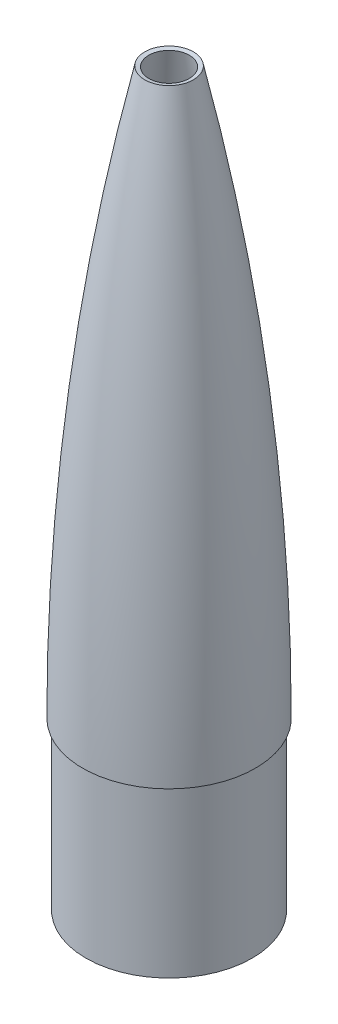
ISO-10303-21;
HEADER;
FILE_DESCRIPTION(('STEP AP214'),'2;1');
FILE_NAME('part.step','',(''),(''),'','','');
FILE_SCHEMA(('AUTOMOTIVE_DESIGN { 1 0 10303 214 1 1 1 1 }'));
ENDSEC;
DATA;
#1=APPLICATION_CONTEXT('core data for automotive mechanical design processes');
#2=APPLICATION_PROTOCOL_DEFINITION('international standard','automotive_design',2000,#1);
#3=PRODUCT_CONTEXT('',#1,'mechanical');
#4=PRODUCT('Part','Part','',(#3));
#5=PRODUCT_RELATED_PRODUCT_CATEGORY('part','',(#4));
#6=PRODUCT_DEFINITION_FORMATION('','',#4);
#7=PRODUCT_DEFINITION_CONTEXT('part definition',#1,'design');
#8=PRODUCT_DEFINITION('design','',#6,#7);
#9=PRODUCT_DEFINITION_SHAPE('','',#8);
#10=(LENGTH_UNIT() NAMED_UNIT(*) SI_UNIT(.MILLI.,.METRE.));
#11=(NAMED_UNIT(*) PLANE_ANGLE_UNIT() SI_UNIT($,.RADIAN.));
#12=(NAMED_UNIT(*) SI_UNIT($,.STERADIAN.) SOLID_ANGLE_UNIT());
#13=UNCERTAINTY_MEASURE_WITH_UNIT(LENGTH_MEASURE(1.E-05),#10,'distance_accuracy_value','');
#14=(GEOMETRIC_REPRESENTATION_CONTEXT(3) GLOBAL_UNCERTAINTY_ASSIGNED_CONTEXT((#13)) GLOBAL_UNIT_ASSIGNED_CONTEXT((#10,
#11,#12)) REPRESENTATION_CONTEXT('',''));
#15=CARTESIAN_POINT('',(0.,0.,0.));
#16=DIRECTION('',(0.,0.,1.));
#17=DIRECTION('',(1.,0.,0.));
#18=AXIS2_PLACEMENT_3D('',#15,#16,#17);
#19=CARTESIAN_POINT('',(0.,0.,0.));
#20=DIRECTION('',(0.,-1.,0.));
#21=DIRECTION('',(0.,0.,-1.));
#22=AXIS2_PLACEMENT_3D('',#19,#20,#21);
#23=DEGENERATE_TOROIDAL_SURFACE('',#22,1920.82615384615,1986.86615384615,.F.);
#24=CARTESIAN_POINT('',(0.,431.8,0.));
#25=DIRECTION('',(0.,-1.,0.));
#26=DIRECTION('',(0.,0.,-1.));
#27=AXIS2_PLACEMENT_3D('',#24,#25,#26);
#28=CIRCLE('',#27,18.5515487428516);
#29=CARTESIAN_POINT('',(0.,431.8,-18.5515487428516));
#30=VERTEX_POINT('',#29);
#31=EDGE_CURVE('E10',#30,#30,#28,.T.);
#32=ORIENTED_EDGE('',*,*,#31,.T.);
#33=EDGE_LOOP('',(#32));
#34=FACE_BOUND('',#33,.T.);
#35=CARTESIAN_POINT('',(0.,0.,0.));
#36=DIRECTION('',(0.,-1.,0.));
#37=DIRECTION('',(0.,0.,-1.));
#38=AXIS2_PLACEMENT_3D('',#35,#36,#37);
#39=CIRCLE('',#38,66.04);
#40=CARTESIAN_POINT('',(0.,0.,-66.04));
#41=VERTEX_POINT('',#40);
#42=EDGE_CURVE('E59',#41,#41,#39,.T.);
#43=ORIENTED_EDGE('',*,*,#42,.F.);
#44=EDGE_LOOP('',(#43));
#45=FACE_BOUND('',#44,.T.);
#46=ADVANCED_FACE('F31',(#34,#45),#23,.F.);
#47=CARTESIAN_POINT('',(0.,431.109986232668,0.));
#48=DIRECTION('',(0.,1.,0.));
#49=DIRECTION('',(0.,0.,1.));
#50=AXIS2_PLACEMENT_3D('',#47,#48,#49);
#51=CONICAL_SURFACE('',#50,15.4524349984253,1.35172097221438);
#52=ORIENTED_EDGE('',*,*,#31,.F.);
#53=EDGE_LOOP('',(#52));
#54=FACE_BOUND('',#53,.T.);
#55=CARTESIAN_POINT('',(0.,431.109986232668,0.));
#56=DIRECTION('',(0.,-1.,0.));
#57=DIRECTION('',(0.,0.,-1.));
#58=AXIS2_PLACEMENT_3D('',#55,#56,#57);
#59=CIRCLE('',#58,15.4524349984253);
#60=CARTESIAN_POINT('',(0.,431.109986232668,-15.4524349984253));
#61=VERTEX_POINT('',#60);
#62=EDGE_CURVE('E37',#61,#61,#59,.T.);
#63=ORIENTED_EDGE('',*,*,#62,.T.);
#64=EDGE_LOOP('',(#63));
#65=FACE_BOUND('',#64,.T.);
#66=ADVANCED_FACE('F67',(#54,#65),#51,.F.);
#67=CARTESIAN_POINT('',(0.,0.,0.));
#68=DIRECTION('',(0.,-1.,0.));
#69=DIRECTION('',(0.,0.,-1.));
#70=AXIS2_PLACEMENT_3D('',#67,#68,#69);
#71=DEGENERATE_TOROIDAL_SURFACE('',#70,1920.82615384615,1983.69115384615,.F.);
#72=ORIENTED_EDGE('',*,*,#62,.F.);
#73=EDGE_LOOP('',(#72));
#74=FACE_BOUND('',#73,.T.);
#75=CARTESIAN_POINT('',(0.,3.175,0.));
#76=DIRECTION('',(0.,-1.,0.));
#77=DIRECTION('',(0.,0.,-1.));
#78=AXIS2_PLACEMENT_3D('',#75,#76,#77);
#79=CIRCLE('',#78,62.862459122748);
#80=CARTESIAN_POINT('',(0.,3.175,-62.862459122748));
#81=VERTEX_POINT('',#80);
#82=EDGE_CURVE('E41',#81,#81,#79,.T.);
#83=ORIENTED_EDGE('',*,*,#82,.T.);
#84=EDGE_LOOP('',(#83));
#85=FACE_BOUND('',#84,.T.);
#86=ADVANCED_FACE('F71',(#74,#85),#71,.T.);
#87=CARTESIAN_POINT('',(66.04,3.175,0.));
#88=DIRECTION('',(0.,-1.,0.));
#89=DIRECTION('',(0.,0.,-1.));
#90=AXIS2_PLACEMENT_3D('',#87,#88,#89);
#91=PLANE('',#90);
#92=ORIENTED_EDGE('',*,*,#82,.F.);
#93=EDGE_LOOP('',(#92));
#94=FACE_BOUND('',#93,.T.);
#95=CARTESIAN_POINT('',(0.,3.175,0.));
#96=DIRECTION('',(0.,-1.,0.));
#97=DIRECTION('',(0.,0.,-1.));
#98=AXIS2_PLACEMENT_3D('',#95,#96,#97);
#99=CIRCLE('',#98,60.325);
#100=CARTESIAN_POINT('',(0.,3.175,-60.325));
#101=VERTEX_POINT('',#100);
#102=EDGE_CURVE('E45',#101,#101,#99,.T.);
#103=ORIENTED_EDGE('',*,*,#102,.T.);
#104=EDGE_LOOP('',(#103));
#105=FACE_BOUND('',#104,.T.);
#106=ADVANCED_FACE('F76',(#94,#105),#91,.F.);
#107=CARTESIAN_POINT('',(0.,0.,0.));
#108=DIRECTION('',(0.,-1.,0.));
#109=DIRECTION('',(0.,0.,-1.));
#110=AXIS2_PLACEMENT_3D('',#107,#108,#109);
#111=CYLINDRICAL_SURFACE('',#110,60.325);
#112=ORIENTED_EDGE('',*,*,#102,.F.);
#113=EDGE_LOOP('',(#112));
#114=FACE_BOUND('',#113,.T.);
#115=CARTESIAN_POINT('',(0.,-127.,0.));
#116=DIRECTION('',(0.,-1.,0.));
#117=DIRECTION('',(0.,0.,-1.));
#118=AXIS2_PLACEMENT_3D('',#115,#116,#117);
#119=CIRCLE('',#118,60.325);
#120=CARTESIAN_POINT('',(0.,-127.,-60.325));
#121=VERTEX_POINT('',#120);
#122=EDGE_CURVE('E50',#121,#121,#119,.T.);
#123=ORIENTED_EDGE('',*,*,#122,.T.);
#124=EDGE_LOOP('',(#123));
#125=FACE_BOUND('',#124,.T.);
#126=ADVANCED_FACE('F82',(#114,#125),#111,.F.);
#127=CARTESIAN_POINT('',(63.5,-127.,0.));
#128=DIRECTION('',(0.,1.,0.));
#129=DIRECTION('',(0.,0.,1.));
#130=AXIS2_PLACEMENT_3D('',#127,#128,#129);
#131=PLANE('',#130);
#132=ORIENTED_EDGE('',*,*,#122,.F.);
#133=EDGE_LOOP('',(#132));
#134=FACE_BOUND('',#133,.T.);
#135=CARTESIAN_POINT('',(0.,-127.,0.));
#136=DIRECTION('',(0.,-1.,0.));
#137=DIRECTION('',(0.,0.,-1.));
#138=AXIS2_PLACEMENT_3D('',#135,#136,#137);
#139=CIRCLE('',#138,63.5);
#140=CARTESIAN_POINT('',(0.,-127.,-63.5));
#141=VERTEX_POINT('',#140);
#142=EDGE_CURVE('E53',#141,#141,#139,.T.);
#143=ORIENTED_EDGE('',*,*,#142,.T.);
#144=EDGE_LOOP('',(#143));
#145=FACE_BOUND('',#144,.T.);
#146=ADVANCED_FACE('F86',(#134,#145),#131,.F.);
#147=CARTESIAN_POINT('',(0.,0.,0.));
#148=DIRECTION('',(0.,-1.,0.));
#149=DIRECTION('',(0.,0.,-1.));
#150=AXIS2_PLACEMENT_3D('',#147,#148,#149);
#151=CYLINDRICAL_SURFACE('',#150,63.5);
#152=CARTESIAN_POINT('',(0.,0.,0.));
#153=DIRECTION('',(0.,-1.,0.));
#154=DIRECTION('',(0.,0.,-1.));
#155=AXIS2_PLACEMENT_3D('',#152,#153,#154);
#156=CIRCLE('',#155,63.5);
#157=CARTESIAN_POINT('',(0.,0.,-63.5));
#158=VERTEX_POINT('',#157);
#159=EDGE_CURVE('E56',#158,#158,#156,.T.);
#160=ORIENTED_EDGE('',*,*,#159,.T.);
#161=EDGE_LOOP('',(#160));
#162=FACE_BOUND('',#161,.T.);
#163=ORIENTED_EDGE('',*,*,#142,.F.);
#164=EDGE_LOOP('',(#163));
#165=FACE_BOUND('',#164,.T.);
#166=ADVANCED_FACE('F90',(#162,#165),#151,.T.);
#167=CARTESIAN_POINT('',(66.04,0.,0.));
#168=DIRECTION('',(0.,-1.,0.));
#169=DIRECTION('',(0.,0.,-1.));
#170=AXIS2_PLACEMENT_3D('',#167,#168,#169);
#171=PLANE('',#170);
#172=ORIENTED_EDGE('',*,*,#42,.T.);
#173=EDGE_LOOP('',(#172));
#174=FACE_BOUND('',#173,.T.);
#175=ORIENTED_EDGE('',*,*,#159,.F.);
#176=EDGE_LOOP('',(#175));
#177=FACE_BOUND('',#176,.T.);
#178=ADVANCED_FACE('F63',(#174,#177),#171,.T.);
#179=CLOSED_SHELL('',(#46,#66,#86,#106,#126,#146,#166,#178));
#180=MANIFOLD_SOLID_BREP('B2',#179);
#181=ADVANCED_BREP_SHAPE_REPRESENTATION('',(#18,#180),#14);
#182=SHAPE_DEFINITION_REPRESENTATION(#9,#181);
ENDSEC;
END-ISO-10303-21;
